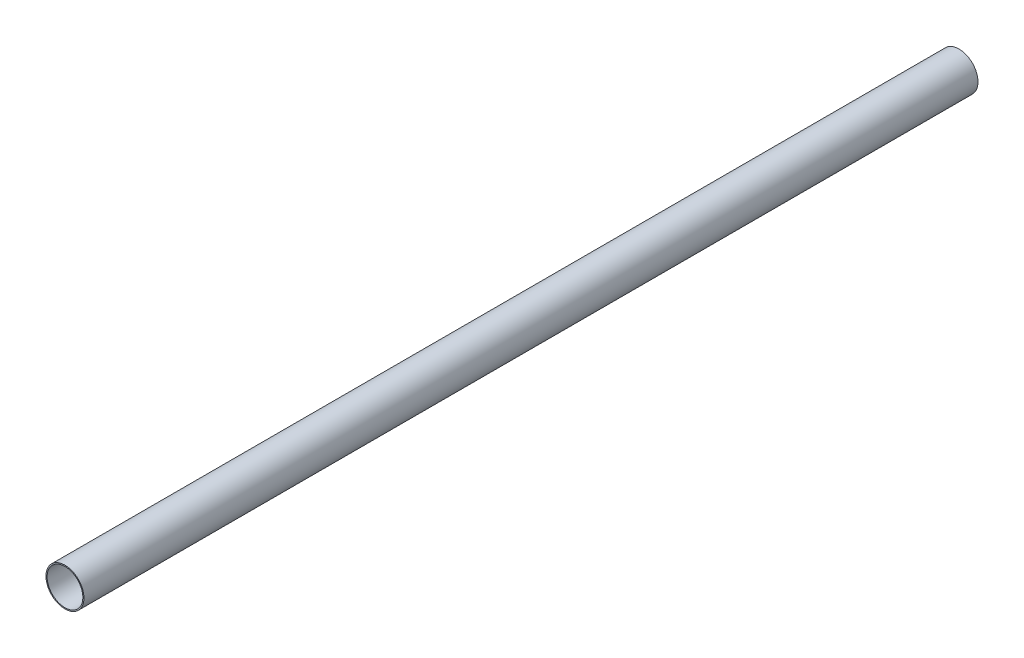
ISO-10303-21;
HEADER;
FILE_DESCRIPTION(('STEP AP214'),'2;1');
FILE_NAME('part.step','',(''),(''),'','','');
FILE_SCHEMA(('AUTOMOTIVE_DESIGN { 1 0 10303 214 1 1 1 1 }'));
ENDSEC;
DATA;
#1=APPLICATION_CONTEXT('core data for automotive mechanical design processes');
#2=APPLICATION_PROTOCOL_DEFINITION('international standard','automotive_design',2000,#1);
#3=PRODUCT_CONTEXT('',#1,'mechanical');
#4=PRODUCT('Part','Part','',(#3));
#5=PRODUCT_RELATED_PRODUCT_CATEGORY('part','',(#4));
#6=PRODUCT_DEFINITION_FORMATION('','',#4);
#7=PRODUCT_DEFINITION_CONTEXT('part definition',#1,'design');
#8=PRODUCT_DEFINITION('design','',#6,#7);
#9=PRODUCT_DEFINITION_SHAPE('','',#8);
#10=(LENGTH_UNIT() NAMED_UNIT(*) SI_UNIT(.MILLI.,.METRE.));
#11=(NAMED_UNIT(*) PLANE_ANGLE_UNIT() SI_UNIT($,.RADIAN.));
#12=(NAMED_UNIT(*) SI_UNIT($,.STERADIAN.) SOLID_ANGLE_UNIT());
#13=UNCERTAINTY_MEASURE_WITH_UNIT(LENGTH_MEASURE(1.E-05),#10,'distance_accuracy_value','');
#14=(GEOMETRIC_REPRESENTATION_CONTEXT(3) GLOBAL_UNCERTAINTY_ASSIGNED_CONTEXT((#13)) GLOBAL_UNIT_ASSIGNED_CONTEXT((#10,
#11,#12)) REPRESENTATION_CONTEXT('',''));
#15=CARTESIAN_POINT('',(0.,0.,0.));
#16=DIRECTION('',(0.,0.,1.));
#17=DIRECTION('',(1.,0.,0.));
#18=AXIS2_PLACEMENT_3D('',#15,#16,#17);
#19=CARTESIAN_POINT('',(0.,0.,200.));
#20=DIRECTION('',(0.,0.,1.));
#21=DIRECTION('',(1.,0.,0.));
#22=AXIS2_PLACEMENT_3D('',#19,#20,#21);
#23=PLANE('',#22);
#24=CARTESIAN_POINT('',(0.,0.,200.));
#25=DIRECTION('',(0.,0.,1.));
#26=DIRECTION('',(1.,0.,0.));
#27=AXIS2_PLACEMENT_3D('',#24,#25,#26);
#28=CIRCLE('',#27,4.25);
#29=CARTESIAN_POINT('',(4.25,0.,200.));
#30=VERTEX_POINT('',#29);
#31=EDGE_CURVE('E10',#30,#30,#28,.T.);
#32=ORIENTED_EDGE('',*,*,#31,.T.);
#33=EDGE_LOOP('',(#32));
#34=FACE_BOUND('',#33,.T.);
#35=CARTESIAN_POINT('',(0.,0.,200.));
#36=DIRECTION('',(0.,0.,1.));
#37=DIRECTION('',(1.,0.,0.));
#38=AXIS2_PLACEMENT_3D('',#35,#36,#37);
#39=CIRCLE('',#38,4.);
#40=CARTESIAN_POINT('',(4.,0.,200.));
#41=VERTEX_POINT('',#40);
#42=EDGE_CURVE('E42',#41,#41,#39,.T.);
#43=ORIENTED_EDGE('',*,*,#42,.F.);
#44=EDGE_LOOP('',(#43));
#45=FACE_BOUND('',#44,.T.);
#46=ADVANCED_FACE('F31',(#34,#45),#23,.T.);
#47=CARTESIAN_POINT('',(0.,0.,0.));
#48=DIRECTION('',(0.,0.,1.));
#49=DIRECTION('',(1.,0.,0.));
#50=AXIS2_PLACEMENT_3D('',#47,#48,#49);
#51=PLANE('',#50);
#52=CARTESIAN_POINT('',(0.,0.,0.));
#53=DIRECTION('',(0.,0.,1.));
#54=DIRECTION('',(1.,0.,0.));
#55=AXIS2_PLACEMENT_3D('',#52,#53,#54);
#56=CIRCLE('',#55,4.25);
#57=CARTESIAN_POINT('',(4.25,0.,0.));
#58=VERTEX_POINT('',#57);
#59=EDGE_CURVE('E35',#58,#58,#56,.T.);
#60=ORIENTED_EDGE('',*,*,#59,.F.);
#61=EDGE_LOOP('',(#60));
#62=FACE_BOUND('',#61,.T.);
#63=CARTESIAN_POINT('',(0.,0.,0.));
#64=DIRECTION('',(0.,0.,1.));
#65=DIRECTION('',(1.,0.,0.));
#66=AXIS2_PLACEMENT_3D('',#63,#64,#65);
#67=CIRCLE('',#66,4.);
#68=CARTESIAN_POINT('',(4.,0.,0.));
#69=VERTEX_POINT('',#68);
#70=EDGE_CURVE('E44',#69,#69,#67,.T.);
#71=ORIENTED_EDGE('',*,*,#70,.T.);
#72=EDGE_LOOP('',(#71));
#73=FACE_BOUND('',#72,.T.);
#74=ADVANCED_FACE('F54',(#62,#73),#51,.F.);
#75=CARTESIAN_POINT('',(0.,0.,200.));
#76=DIRECTION('',(0.,0.,-1.));
#77=DIRECTION('',(-1.,0.,0.));
#78=AXIS2_PLACEMENT_3D('',#75,#76,#77);
#79=CYLINDRICAL_SURFACE('',#78,4.25);
#80=ORIENTED_EDGE('',*,*,#31,.F.);
#81=EDGE_LOOP('',(#80));
#82=FACE_BOUND('',#81,.T.);
#83=ORIENTED_EDGE('',*,*,#59,.T.);
#84=EDGE_LOOP('',(#83));
#85=FACE_BOUND('',#84,.T.);
#86=ADVANCED_FACE('F33',(#82,#85),#79,.T.);
#87=CARTESIAN_POINT('',(0.,0.,200.));
#88=DIRECTION('',(0.,0.,-1.));
#89=DIRECTION('',(-1.,0.,0.));
#90=AXIS2_PLACEMENT_3D('',#87,#88,#89);
#91=CYLINDRICAL_SURFACE('',#90,4.);
#92=ORIENTED_EDGE('',*,*,#42,.T.);
#93=EDGE_LOOP('',(#92));
#94=FACE_BOUND('',#93,.T.);
#95=ORIENTED_EDGE('',*,*,#70,.F.);
#96=EDGE_LOOP('',(#95));
#97=FACE_BOUND('',#96,.T.);
#98=ADVANCED_FACE('F50',(#94,#97),#91,.F.);
#99=CLOSED_SHELL('',(#46,#74,#86,#98));
#100=MANIFOLD_SOLID_BREP('B2',#99);
#101=ADVANCED_BREP_SHAPE_REPRESENTATION('',(#18,#100),#14);
#102=SHAPE_DEFINITION_REPRESENTATION(#9,#101);
ENDSEC;
END-ISO-10303-21;
